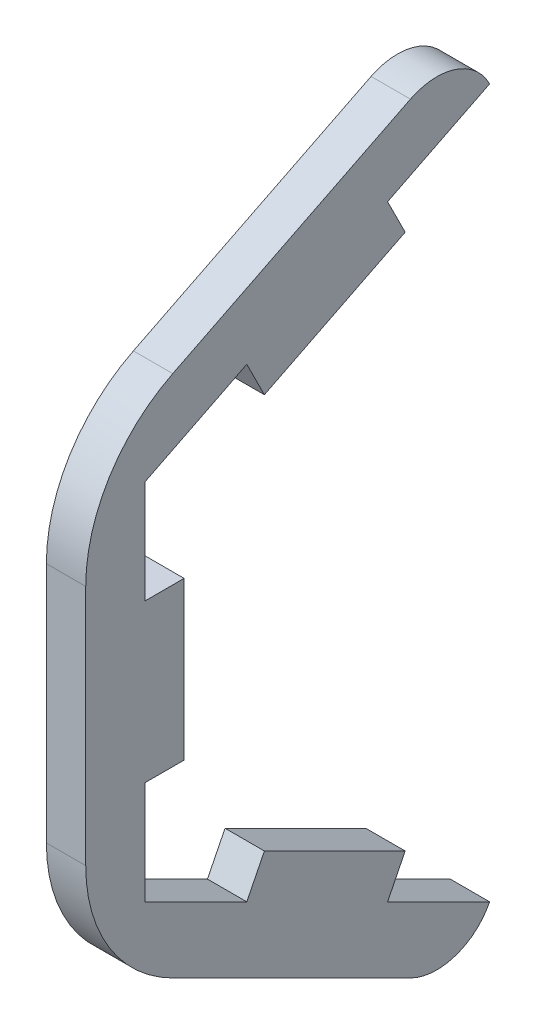
ISO-10303-21;
HEADER;
FILE_DESCRIPTION(('STEP AP214'),'2;1');
FILE_NAME('part.step','',(''),(''),'','','');
FILE_SCHEMA(('AUTOMOTIVE_DESIGN { 1 0 10303 214 1 1 1 1 }'));
ENDSEC;
DATA;
#1=APPLICATION_CONTEXT('core data for automotive mechanical design processes');
#2=APPLICATION_PROTOCOL_DEFINITION('international standard','automotive_design',2000,#1);
#3=PRODUCT_CONTEXT('',#1,'mechanical');
#4=PRODUCT('Part','Part','',(#3));
#5=PRODUCT_RELATED_PRODUCT_CATEGORY('part','',(#4));
#6=PRODUCT_DEFINITION_FORMATION('','',#4);
#7=PRODUCT_DEFINITION_CONTEXT('part definition',#1,'design');
#8=PRODUCT_DEFINITION('design','',#6,#7);
#9=PRODUCT_DEFINITION_SHAPE('','',#8);
#10=(LENGTH_UNIT() NAMED_UNIT(*) SI_UNIT(.MILLI.,.METRE.));
#11=(NAMED_UNIT(*) PLANE_ANGLE_UNIT() SI_UNIT($,.RADIAN.));
#12=(NAMED_UNIT(*) SI_UNIT($,.STERADIAN.) SOLID_ANGLE_UNIT());
#13=UNCERTAINTY_MEASURE_WITH_UNIT(LENGTH_MEASURE(1.E-05),#10,'distance_accuracy_value','');
#14=(GEOMETRIC_REPRESENTATION_CONTEXT(3) GLOBAL_UNCERTAINTY_ASSIGNED_CONTEXT((#13)) GLOBAL_UNIT_ASSIGNED_CONTEXT((#10,
#11,#12)) REPRESENTATION_CONTEXT('',''));
#15=CARTESIAN_POINT('',(0.,0.,0.));
#16=DIRECTION('',(0.,0.,1.));
#17=DIRECTION('',(1.,0.,0.));
#18=AXIS2_PLACEMENT_3D('',#15,#16,#17);
#19=CARTESIAN_POINT('',(6.35,110.581612662849,55.2908063314247));
#20=DIRECTION('',(0.,0.894427190999916,0.447213595499958));
#21=DIRECTION('',(0.,-0.447213595499958,0.894427190999916));
#22=AXIS2_PLACEMENT_3D('',#19,#20,#21);
#23=PLANE('',#22);
#24=DIRECTION('',(0.,-0.447213595499958,0.894427190999916));
#25=VECTOR('',#24,1.);
#26=CARTESIAN_POINT('',(12.7,110.581612662849,55.2908063314247));
#27=LINE('',#26,#25);
#28=CARTESIAN_POINT('',(12.7,57.15,162.154031657124));
#29=VERTEX_POINT('',#28);
#30=CARTESIAN_POINT('',(12.7,48.9168705771304,178.620290502863));
#31=VERTEX_POINT('',#30);
#32=EDGE_CURVE('E199',#29,#31,#27,.T.);
#33=ORIENTED_EDGE('',*,*,#32,.T.);
#34=DIRECTION('',(1.,0.,0.));
#35=VECTOR('',#34,1.);
#36=CARTESIAN_POINT('',(-24.3672020210175,48.9168705771304,178.620290502863));
#37=LINE('',#36,#35);
#38=CARTESIAN_POINT('',(6.35,48.9168705771304,178.620290502863));
#39=VERTEX_POINT('',#38);
#40=EDGE_CURVE('E226',#39,#31,#37,.T.);
#41=ORIENTED_EDGE('',*,*,#40,.F.);
#42=DIRECTION('',(0.,-0.447213595499958,0.894427190999916));
#43=VECTOR('',#42,1.);
#44=CARTESIAN_POINT('',(6.35,110.581612662849,55.2908063314247));
#45=LINE('',#44,#43);
#46=CARTESIAN_POINT('',(6.35,57.15,162.154031657124));
#47=VERTEX_POINT('',#46);
#48=EDGE_CURVE('E295',#47,#39,#45,.T.);
#49=ORIENTED_EDGE('',*,*,#48,.F.);
#50=DIRECTION('',(1.,0.,0.));
#51=VECTOR('',#50,1.);
#52=CARTESIAN_POINT('',(6.35,57.15,162.154031657124));
#53=LINE('',#52,#51);
#54=EDGE_CURVE('E303',#47,#29,#53,.T.);
#55=ORIENTED_EDGE('',*,*,#54,.T.);
#56=EDGE_LOOP('',(#33,#41,#49,#55));
#57=FACE_BOUND('',#56,.T.);
#58=ADVANCED_FACE('F35',(#57),#23,.F.);
#59=CARTESIAN_POINT('',(6.35,-110.581612662849,55.2908063314247));
#60=DIRECTION('',(0.,-0.894427190999916,0.447213595499958));
#61=DIRECTION('',(0.,-0.447213595499958,-0.894427190999916));
#62=AXIS2_PLACEMENT_3D('',#59,#60,#61);
#63=PLANE('',#62);
#64=DIRECTION('',(0.,-0.447213595499958,-0.894427190999916));
#65=VECTOR('',#64,1.);
#66=CARTESIAN_POINT('',(12.7,-110.581612662849,55.2908063314247));
#67=LINE('',#66,#65);
#68=CARTESIAN_POINT('',(12.7,-29.3245158285618,217.805));
#69=VERTEX_POINT('',#68);
#70=CARTESIAN_POINT('',(12.7,-37.5576452514315,201.338741154261));
#71=VERTEX_POINT('',#70);
#72=EDGE_CURVE('E299',#69,#71,#67,.T.);
#73=ORIENTED_EDGE('',*,*,#72,.T.);
#74=DIRECTION('',(1.,0.,0.));
#75=VECTOR('',#74,1.);
#76=CARTESIAN_POINT('',(-24.3672020210175,-37.5576452514315,201.338741154261));
#77=LINE('',#76,#75);
#78=CARTESIAN_POINT('',(6.35,-37.5576452514315,201.338741154261));
#79=VERTEX_POINT('',#78);
#80=EDGE_CURVE('E239',#79,#71,#77,.T.);
#81=ORIENTED_EDGE('',*,*,#80,.F.);
#82=DIRECTION('',(0.,-0.447213595499958,-0.894427190999916));
#83=VECTOR('',#82,1.);
#84=CARTESIAN_POINT('',(6.35,-110.581612662849,55.2908063314247));
#85=LINE('',#84,#83);
#86=CARTESIAN_POINT('',(6.35,-29.3245158285618,217.805));
#87=VERTEX_POINT('',#86);
#88=EDGE_CURVE('E287',#87,#79,#85,.T.);
#89=ORIENTED_EDGE('',*,*,#88,.F.);
#90=DIRECTION('',(1.,0.,0.));
#91=VECTOR('',#90,1.);
#92=CARTESIAN_POINT('',(6.35,-29.3245158285618,217.805));
#93=LINE('',#92,#91);
#94=EDGE_CURVE('E309',#87,#69,#93,.T.);
#95=ORIENTED_EDGE('',*,*,#94,.T.);
#96=EDGE_LOOP('',(#73,#81,#89,#95));
#97=FACE_BOUND('',#96,.T.);
#98=ADVANCED_FACE('F385',(#97),#63,.F.);
#99=CARTESIAN_POINT('',(6.35,0.,217.805));
#100=DIRECTION('',(0.,0.,1.));
#101=DIRECTION('',(1.,0.,0.));
#102=AXIS2_PLACEMENT_3D('',#99,#100,#101);
#103=PLANE('',#102);
#104=DIRECTION('',(0.,-1.,0.));
#105=VECTOR('',#104,1.);
#106=CARTESIAN_POINT('',(12.7,0.,217.805));
#107=LINE('',#106,#105);
#108=CARTESIAN_POINT('',(12.7,29.3245158285619,217.805));
#109=VERTEX_POINT('',#108);
#110=CARTESIAN_POINT('',(12.7,12.7,217.805));
#111=VERTEX_POINT('',#110);
#112=EDGE_CURVE('E195',#109,#111,#107,.T.);
#113=ORIENTED_EDGE('',*,*,#112,.T.);
#114=DIRECTION('',(1.,0.,0.));
#115=VECTOR('',#114,1.);
#116=CARTESIAN_POINT('',(-24.3672020210175,12.7,217.805));
#117=LINE('',#116,#115);
#118=CARTESIAN_POINT('',(6.35,12.7,217.805));
#119=VERTEX_POINT('',#118);
#120=EDGE_CURVE('E265',#119,#111,#117,.T.);
#121=ORIENTED_EDGE('',*,*,#120,.F.);
#122=DIRECTION('',(0.,-1.,0.));
#123=VECTOR('',#122,1.);
#124=CARTESIAN_POINT('',(6.35,0.,217.805));
#125=LINE('',#124,#123);
#126=CARTESIAN_POINT('',(6.35,29.3245158285619,217.805));
#127=VERTEX_POINT('',#126);
#128=EDGE_CURVE('E292',#127,#119,#125,.T.);
#129=ORIENTED_EDGE('',*,*,#128,.F.);
#130=DIRECTION('',(1.,0.,0.));
#131=VECTOR('',#130,1.);
#132=CARTESIAN_POINT('',(6.35,29.3245158285619,217.805));
#133=LINE('',#132,#131);
#134=EDGE_CURVE('E307',#127,#109,#133,.T.);
#135=ORIENTED_EDGE('',*,*,#134,.T.);
#136=EDGE_LOOP('',(#113,#121,#129,#135));
#137=FACE_BOUND('',#136,.T.);
#138=ADVANCED_FACE('F390',(#137),#103,.F.);
#139=CARTESIAN_POINT('',(6.35,37.5576452514315,201.338741154261));
#140=VERTEX_POINT('',#139);
#141=EDGE_CURVE('E204',#140,#127,#45,.T.);
#142=ORIENTED_EDGE('',*,*,#141,.F.);
#143=DIRECTION('',(1.,0.,0.));
#144=VECTOR('',#143,1.);
#145=CARTESIAN_POINT('',(-24.3672020210175,37.5576452514315,201.338741154261));
#146=LINE('',#145,#144);
#147=CARTESIAN_POINT('',(12.7,37.5576452514315,201.338741154261));
#148=VERTEX_POINT('',#147);
#149=EDGE_CURVE('E202',#140,#148,#146,.T.);
#150=ORIENTED_EDGE('',*,*,#149,.T.);
#151=EDGE_CURVE('E187',#148,#109,#27,.T.);
#152=ORIENTED_EDGE('',*,*,#151,.T.);
#153=ORIENTED_EDGE('',*,*,#134,.F.);
#154=EDGE_LOOP('',(#142,#150,#152,#153));
#155=FACE_BOUND('',#154,.T.);
#156=ADVANCED_FACE('F203',(#155),#23,.F.);
#157=CARTESIAN_POINT('',(6.35,-12.7,217.805));
#158=VERTEX_POINT('',#157);
#159=EDGE_CURVE('E290',#158,#87,#125,.T.);
#160=ORIENTED_EDGE('',*,*,#159,.F.);
#161=DIRECTION('',(1.,0.,0.));
#162=VECTOR('',#161,1.);
#163=CARTESIAN_POINT('',(-24.3672020210175,-12.7,217.805));
#164=LINE('',#163,#162);
#165=CARTESIAN_POINT('',(12.7,-12.7,217.805));
#166=VERTEX_POINT('',#165);
#167=EDGE_CURVE('E275',#158,#166,#164,.T.);
#168=ORIENTED_EDGE('',*,*,#167,.T.);
#169=EDGE_CURVE('E301',#166,#69,#107,.T.);
#170=ORIENTED_EDGE('',*,*,#169,.T.);
#171=ORIENTED_EDGE('',*,*,#94,.F.);
#172=EDGE_LOOP('',(#160,#168,#170,#171));
#173=FACE_BOUND('',#172,.T.);
#174=ADVANCED_FACE('F397',(#173),#103,.F.);
#175=CARTESIAN_POINT('',(6.35,-48.9168705771304,178.620290502863));
#176=VERTEX_POINT('',#175);
#177=CARTESIAN_POINT('',(6.35,-57.15,162.154031657124));
#178=VERTEX_POINT('',#177);
#179=EDGE_CURVE('E291',#176,#178,#85,.T.);
#180=ORIENTED_EDGE('',*,*,#179,.F.);
#181=DIRECTION('',(1.,0.,0.));
#182=VECTOR('',#181,1.);
#183=CARTESIAN_POINT('',(-24.3672020210175,-48.9168705771304,178.620290502863));
#184=LINE('',#183,#182);
#185=CARTESIAN_POINT('',(12.7,-48.9168705771304,178.620290502863));
#186=VERTEX_POINT('',#185);
#187=EDGE_CURVE('E250',#176,#186,#184,.T.);
#188=ORIENTED_EDGE('',*,*,#187,.T.);
#189=CARTESIAN_POINT('',(12.7,-57.15,162.154031657124));
#190=VERTEX_POINT('',#189);
#191=EDGE_CURVE('E286',#186,#190,#67,.T.);
#192=ORIENTED_EDGE('',*,*,#191,.T.);
#193=DIRECTION('',(1.,0.,0.));
#194=VECTOR('',#193,1.);
#195=CARTESIAN_POINT('',(6.35,-57.15,162.154031657124));
#196=LINE('',#195,#194);
#197=EDGE_CURVE('E298',#178,#190,#196,.T.);
#198=ORIENTED_EDGE('',*,*,#197,.F.);
#199=EDGE_LOOP('',(#180,#188,#192,#198));
#200=FACE_BOUND('',#199,.T.);
#201=ADVANCED_FACE('F393',(#200),#63,.F.);
#202=CARTESIAN_POINT('',(6.35,0.,0.));
#203=DIRECTION('',(1.,0.,0.));
#204=DIRECTION('',(0.,0.,-1.));
#205=AXIS2_PLACEMENT_3D('',#202,#203,#204);
#206=PLANE('',#205);
#207=DIRECTION('',(0.,0.447213595499957,0.894427190999916));
#208=VECTOR('',#207,1.);
#209=CARTESIAN_POINT('',(6.35,-50.3367737428428,197.079031657124));
#210=LINE('',#209,#208);
#211=CARTESIAN_POINT('',(6.35,-61.4097094971371,174.933160148535));
#212=VERTEX_POINT('',#211);
#213=CARTESIAN_POINT('',(6.35,-42.2316769085551,213.289225325699));
#214=VERTEX_POINT('',#213);
#215=EDGE_CURVE('E341',#212,#214,#210,.T.);
#216=ORIENTED_EDGE('',*,*,#215,.T.);
#217=CARTESIAN_POINT('',(6.35,-19.5132262571572,201.93));
#218=DIRECTION('',(1.,0.,0.));
#219=DIRECTION('',(0.,0.,-1.));
#220=AXIS2_PLACEMENT_3D('',#217,#218,#219);
#221=CIRCLE('',#220,25.4);
#222=CARTESIAN_POINT('',(6.35,-19.5132262571572,227.33));
#223=VERTEX_POINT('',#222);
#224=EDGE_CURVE('E43',#214,#223,#221,.F.);
#225=ORIENTED_EDGE('',*,*,#224,.T.);
#226=DIRECTION('',(0.,1.,0.));
#227=VECTOR('',#226,1.);
#228=CARTESIAN_POINT('',(6.35,-35.2112895714046,227.33));
#229=LINE('',#228,#227);
#230=CARTESIAN_POINT('',(6.35,19.5132262571573,227.33));
#231=VERTEX_POINT('',#230);
#232=EDGE_CURVE('E218',#223,#231,#229,.T.);
#233=ORIENTED_EDGE('',*,*,#232,.T.);
#234=CARTESIAN_POINT('',(6.35,19.5132262571573,201.93));
#235=DIRECTION('',(1.,0.,0.));
#236=DIRECTION('',(0.,0.,-1.));
#237=AXIS2_PLACEMENT_3D('',#234,#235,#236);
#238=CIRCLE('',#237,25.4);
#239=CARTESIAN_POINT('',(6.35,42.2316769085552,213.289225325699));
#240=VERTEX_POINT('',#239);
#241=EDGE_CURVE('E50',#231,#240,#238,.F.);
#242=ORIENTED_EDGE('',*,*,#241,.T.);
#243=DIRECTION('',(0.,0.447213595499958,-0.894427190999916));
#244=VECTOR('',#243,1.);
#245=CARTESIAN_POINT('',(6.35,35.2112895714046,227.33));
#246=LINE('',#245,#244);
#247=CARTESIAN_POINT('',(6.35,61.4097094971372,174.933160148535));
#248=VERTEX_POINT('',#247);
#249=EDGE_CURVE('E215',#240,#248,#246,.T.);
#250=ORIENTED_EDGE('',*,*,#249,.T.);
#251=CARTESIAN_POINT('',(6.35,52.8902905028629,170.673450651398));
#252=DIRECTION('',(1.,0.,0.));
#253=DIRECTION('',(0.,0.,-1.));
#254=AXIS2_PLACEMENT_3D('',#251,#252,#253);
#255=CIRCLE('',#254,9.525);
#256=EDGE_CURVE('E321',#248,#47,#255,.F.);
#257=ORIENTED_EDGE('',*,*,#256,.T.);
#258=ORIENTED_EDGE('',*,*,#48,.T.);
#259=DIRECTION('',(0.,-0.894427190999917,-0.447213595499956));
#260=VECTOR('',#259,1.);
#261=CARTESIAN_POINT('',(6.35,43.2372579142809,175.780484171438));
#262=LINE('',#261,#260);
#263=CARTESIAN_POINT('',(6.35,43.2372579142809,175.780484171438));
#264=VERTEX_POINT('',#263);
#265=EDGE_CURVE('E221',#39,#264,#262,.T.);
#266=ORIENTED_EDGE('',*,*,#265,.T.);
#267=DIRECTION('',(0.,-0.447213595499957,0.894427190999917));
#268=VECTOR('',#267,1.);
#269=CARTESIAN_POINT('',(6.35,31.878032588582,198.498934822836));
#270=LINE('',#269,#268);
#271=CARTESIAN_POINT('',(6.35,31.878032588582,198.498934822836));
#272=VERTEX_POINT('',#271);
#273=EDGE_CURVE('E229',#264,#272,#270,.T.);
#274=ORIENTED_EDGE('',*,*,#273,.T.);
#275=DIRECTION('',(0.,0.894427190999917,0.447213595499957));
#276=VECTOR('',#275,1.);
#277=CARTESIAN_POINT('',(6.35,37.5576452514315,201.338741154261));
#278=LINE('',#277,#276);
#279=EDGE_CURVE('E233',#272,#140,#278,.T.);
#280=ORIENTED_EDGE('',*,*,#279,.T.);
#281=ORIENTED_EDGE('',*,*,#141,.T.);
#282=ORIENTED_EDGE('',*,*,#128,.T.);
#283=DIRECTION('',(0.,0.,-1.));
#284=VECTOR('',#283,1.);
#285=CARTESIAN_POINT('',(6.35,12.7,217.805));
#286=LINE('',#285,#284);
#287=CARTESIAN_POINT('',(6.35,12.7,211.455));
#288=VERTEX_POINT('',#287);
#289=EDGE_CURVE('E264',#119,#288,#286,.T.);
#290=ORIENTED_EDGE('',*,*,#289,.T.);
#291=DIRECTION('',(0.,-1.,0.));
#292=VECTOR('',#291,1.);
#293=CARTESIAN_POINT('',(6.35,12.7,211.455));
#294=LINE('',#293,#292);
#295=CARTESIAN_POINT('',(6.35,-12.7,211.455));
#296=VERTEX_POINT('',#295);
#297=EDGE_CURVE('E262',#288,#296,#294,.T.);
#298=ORIENTED_EDGE('',*,*,#297,.T.);
#299=DIRECTION('',(0.,0.,1.));
#300=VECTOR('',#299,1.);
#301=CARTESIAN_POINT('',(6.35,-12.7,217.805));
#302=LINE('',#301,#300);
#303=EDGE_CURVE('E267',#296,#158,#302,.T.);
#304=ORIENTED_EDGE('',*,*,#303,.T.);
#305=ORIENTED_EDGE('',*,*,#159,.T.);
#306=ORIENTED_EDGE('',*,*,#88,.T.);
#307=DIRECTION('',(0.,0.894427190999917,-0.447213595499956));
#308=VECTOR('',#307,1.);
#309=CARTESIAN_POINT('',(6.35,-31.878032588582,198.498934822836));
#310=LINE('',#309,#308);
#311=CARTESIAN_POINT('',(6.35,-31.878032588582,198.498934822836));
#312=VERTEX_POINT('',#311);
#313=EDGE_CURVE('E238',#79,#312,#310,.T.);
#314=ORIENTED_EDGE('',*,*,#313,.T.);
#315=DIRECTION('',(0.,-0.447213595499958,-0.894427190999916));
#316=VECTOR('',#315,1.);
#317=CARTESIAN_POINT('',(6.35,-43.2372579142809,175.780484171438));
#318=LINE('',#317,#316);
#319=CARTESIAN_POINT('',(6.35,-43.2372579142809,175.780484171438));
#320=VERTEX_POINT('',#319);
#321=EDGE_CURVE('E236',#312,#320,#318,.T.);
#322=ORIENTED_EDGE('',*,*,#321,.T.);
#323=DIRECTION('',(0.,-0.894427190999919,0.447213595499953));
#324=VECTOR('',#323,1.);
#325=CARTESIAN_POINT('',(6.35,-48.9168705771304,178.620290502863));
#326=LINE('',#325,#324);
#327=EDGE_CURVE('E241',#320,#176,#326,.T.);
#328=ORIENTED_EDGE('',*,*,#327,.T.);
#329=ORIENTED_EDGE('',*,*,#179,.T.);
#330=CARTESIAN_POINT('',(6.35,-52.8902905028629,170.673450651398));
#331=DIRECTION('',(1.,0.,0.));
#332=DIRECTION('',(0.,0.,-1.));
#333=AXIS2_PLACEMENT_3D('',#330,#331,#332);
#334=CIRCLE('',#333,9.525);
#335=EDGE_CURVE('E323',#178,#212,#334,.F.);
#336=ORIENTED_EDGE('',*,*,#335,.T.);
#337=EDGE_LOOP('',(#216,#225,#233,#242,#250,#257,#258,#266,#274,#280,#281,#282,#290,#298,#304,
#305,#306,#314,#322,#328,#329,#336));
#338=FACE_BOUND('',#337,.T.);
#339=ADVANCED_FACE('F340',(#338),#206,.F.);
#340=CARTESIAN_POINT('',(12.7,0.,0.));
#341=DIRECTION('',(1.,0.,0.));
#342=DIRECTION('',(0.,0.,-1.));
#343=AXIS2_PLACEMENT_3D('',#340,#341,#342);
#344=PLANE('',#343);
#345=DIRECTION('',(0.,1.,0.));
#346=VECTOR('',#345,1.);
#347=CARTESIAN_POINT('',(12.7,3.175,227.33));
#348=LINE('',#347,#346);
#349=CARTESIAN_POINT('',(12.7,-19.5132262571572,227.33));
#350=VERTEX_POINT('',#349);
#351=CARTESIAN_POINT('',(12.7,19.5132262571573,227.33));
#352=VERTEX_POINT('',#351);
#353=EDGE_CURVE('E352',#350,#352,#348,.T.);
#354=ORIENTED_EDGE('',*,*,#353,.F.);
#355=CARTESIAN_POINT('',(12.7,-19.5132262571572,201.93));
#356=DIRECTION('',(1.,0.,0.));
#357=DIRECTION('',(0.,0.,-1.));
#358=AXIS2_PLACEMENT_3D('',#355,#356,#357);
#359=CIRCLE('',#358,25.4);
#360=CARTESIAN_POINT('',(12.7,-42.2316769085551,213.289225325699));
#361=VERTEX_POINT('',#360);
#362=EDGE_CURVE('E335',#350,#361,#359,.T.);
#363=ORIENTED_EDGE('',*,*,#362,.T.);
#364=DIRECTION('',(0.,0.447213595499958,0.894427190999916));
#365=VECTOR('',#364,1.);
#366=CARTESIAN_POINT('',(12.7,-50.3367737428428,197.079031657124));
#367=LINE('',#366,#365);
#368=CARTESIAN_POINT('',(12.7,-61.4097094971371,174.933160148535));
#369=VERTEX_POINT('',#368);
#370=EDGE_CURVE('E351',#369,#361,#367,.T.);
#371=ORIENTED_EDGE('',*,*,#370,.F.);
#372=CARTESIAN_POINT('',(12.7,-52.8902905028629,170.673450651398));
#373=DIRECTION('',(1.,0.,0.));
#374=DIRECTION('',(0.,0.,-1.));
#375=AXIS2_PLACEMENT_3D('',#372,#373,#374);
#376=CIRCLE('',#375,9.525);
#377=EDGE_CURVE('E319',#369,#190,#376,.T.);
#378=ORIENTED_EDGE('',*,*,#377,.T.);
#379=ORIENTED_EDGE('',*,*,#191,.F.);
#380=DIRECTION('',(0.,0.894427190999918,-0.447213595499953));
#381=VECTOR('',#380,1.);
#382=CARTESIAN_POINT('',(12.7,-48.9168705771304,178.620290502863));
#383=LINE('',#382,#381);
#384=CARTESIAN_POINT('',(12.7,-43.2372579142809,175.780484171438));
#385=VERTEX_POINT('',#384);
#386=EDGE_CURVE('E235',#186,#385,#383,.T.);
#387=ORIENTED_EDGE('',*,*,#386,.T.);
#388=DIRECTION('',(0.,0.447213595499958,0.894427190999916));
#389=VECTOR('',#388,1.);
#390=CARTESIAN_POINT('',(12.7,-43.2372579142809,175.780484171438));
#391=LINE('',#390,#389);
#392=CARTESIAN_POINT('',(12.7,-31.878032588582,198.498934822836));
#393=VERTEX_POINT('',#392);
#394=EDGE_CURVE('E244',#385,#393,#391,.T.);
#395=ORIENTED_EDGE('',*,*,#394,.T.);
#396=DIRECTION('',(0.,-0.894427190999917,0.447213595499956));
#397=VECTOR('',#396,1.);
#398=CARTESIAN_POINT('',(12.7,-31.878032588582,198.498934822836));
#399=LINE('',#398,#397);
#400=EDGE_CURVE('E247',#393,#71,#399,.T.);
#401=ORIENTED_EDGE('',*,*,#400,.T.);
#402=ORIENTED_EDGE('',*,*,#72,.F.);
#403=ORIENTED_EDGE('',*,*,#169,.F.);
#404=DIRECTION('',(0.,0.,-1.));
#405=VECTOR('',#404,1.);
#406=CARTESIAN_POINT('',(12.7,-12.7,217.805));
#407=LINE('',#406,#405);
#408=CARTESIAN_POINT('',(12.7,-12.7,211.455));
#409=VERTEX_POINT('',#408);
#410=EDGE_CURVE('E261',#166,#409,#407,.T.);
#411=ORIENTED_EDGE('',*,*,#410,.T.);
#412=DIRECTION('',(0.,1.,0.));
#413=VECTOR('',#412,1.);
#414=CARTESIAN_POINT('',(12.7,12.7,211.455));
#415=LINE('',#414,#413);
#416=CARTESIAN_POINT('',(12.7,12.7,211.455));
#417=VERTEX_POINT('',#416);
#418=EDGE_CURVE('E270',#409,#417,#415,.T.);
#419=ORIENTED_EDGE('',*,*,#418,.T.);
#420=DIRECTION('',(0.,0.,1.));
#421=VECTOR('',#420,1.);
#422=CARTESIAN_POINT('',(12.7,12.7,217.805));
#423=LINE('',#422,#421);
#424=EDGE_CURVE('E273',#417,#111,#423,.T.);
#425=ORIENTED_EDGE('',*,*,#424,.T.);
#426=ORIENTED_EDGE('',*,*,#112,.F.);
#427=ORIENTED_EDGE('',*,*,#151,.F.);
#428=DIRECTION('',(0.,-0.894427190999917,-0.447213595499957));
#429=VECTOR('',#428,1.);
#430=CARTESIAN_POINT('',(12.7,37.5576452514315,201.338741154261));
#431=LINE('',#430,#429);
#432=CARTESIAN_POINT('',(12.7,31.878032588582,198.498934822836));
#433=VERTEX_POINT('',#432);
#434=EDGE_CURVE('E193',#148,#433,#431,.T.);
#435=ORIENTED_EDGE('',*,*,#434,.T.);
#436=DIRECTION('',(0.,0.447213595499957,-0.894427190999916));
#437=VECTOR('',#436,1.);
#438=CARTESIAN_POINT('',(12.7,31.878032588582,198.498934822836));
#439=LINE('',#438,#437);
#440=CARTESIAN_POINT('',(12.7,43.2372579142809,175.780484171438));
#441=VERTEX_POINT('',#440);
#442=EDGE_CURVE('E214',#433,#441,#439,.T.);
#443=ORIENTED_EDGE('',*,*,#442,.T.);
#444=DIRECTION('',(0.,0.894427190999917,0.447213595499956));
#445=VECTOR('',#444,1.);
#446=CARTESIAN_POINT('',(12.7,43.2372579142809,175.780484171438));
#447=LINE('',#446,#445);
#448=EDGE_CURVE('E209',#441,#31,#447,.T.);
#449=ORIENTED_EDGE('',*,*,#448,.T.);
#450=ORIENTED_EDGE('',*,*,#32,.F.);
#451=CARTESIAN_POINT('',(12.7,52.8902905028629,170.673450651398));
#452=DIRECTION('',(1.,0.,0.));
#453=DIRECTION('',(0.,0.,-1.));
#454=AXIS2_PLACEMENT_3D('',#451,#452,#453);
#455=CIRCLE('',#454,9.525);
#456=CARTESIAN_POINT('',(12.7,61.4097094971371,174.933160148535));
#457=VERTEX_POINT('',#456);
#458=EDGE_CURVE('E316',#29,#457,#455,.T.);
#459=ORIENTED_EDGE('',*,*,#458,.T.);
#460=DIRECTION('',(0.,0.447213595499956,-0.894427190999917));
#461=VECTOR('',#460,1.);
#462=CARTESIAN_POINT('',(12.7,50.3367737428428,197.079031657124));
#463=LINE('',#462,#461);
#464=CARTESIAN_POINT('',(12.7,42.2316769085552,213.289225325699));
#465=VERTEX_POINT('',#464);
#466=EDGE_CURVE('E356',#465,#457,#463,.T.);
#467=ORIENTED_EDGE('',*,*,#466,.F.);
#468=CARTESIAN_POINT('',(12.7,19.5132262571573,201.93));
#469=DIRECTION('',(1.,0.,0.));
#470=DIRECTION('',(0.,0.,-1.));
#471=AXIS2_PLACEMENT_3D('',#468,#469,#470);
#472=CIRCLE('',#471,25.4);
#473=EDGE_CURVE('E333',#465,#352,#472,.T.);
#474=ORIENTED_EDGE('',*,*,#473,.T.);
#475=EDGE_LOOP('',(#354,#363,#371,#378,#379,#387,#395,#401,#402,#403,#411,#419,#425,#426,#427,
#435,#443,#449,#450,#459,#467,#474));
#476=FACE_BOUND('',#475,.T.);
#477=ADVANCED_FACE('F190',(#476),#344,.T.);
#478=CARTESIAN_POINT('',(-24.3672020210175,12.7,217.805));
#479=DIRECTION('',(0.,1.,0.));
#480=DIRECTION('',(0.,0.,1.));
#481=AXIS2_PLACEMENT_3D('',#478,#479,#480);
#482=PLANE('',#481);
#483=ORIENTED_EDGE('',*,*,#289,.F.);
#484=ORIENTED_EDGE('',*,*,#120,.T.);
#485=ORIENTED_EDGE('',*,*,#424,.F.);
#486=DIRECTION('',(1.,0.,0.));
#487=VECTOR('',#486,1.);
#488=CARTESIAN_POINT('',(-24.3672020210175,12.7,211.455));
#489=LINE('',#488,#487);
#490=EDGE_CURVE('E278',#288,#417,#489,.T.);
#491=ORIENTED_EDGE('',*,*,#490,.F.);
#492=EDGE_LOOP('',(#483,#484,#485,#491));
#493=FACE_BOUND('',#492,.T.);
#494=ADVANCED_FACE('F465',(#493),#482,.T.);
#495=CARTESIAN_POINT('',(-24.3672020210175,12.7,211.455));
#496=DIRECTION('',(0.,0.,-1.));
#497=DIRECTION('',(0.,1.,0.));
#498=AXIS2_PLACEMENT_3D('',#495,#496,#497);
#499=PLANE('',#498);
#500=ORIENTED_EDGE('',*,*,#297,.F.);
#501=ORIENTED_EDGE('',*,*,#490,.T.);
#502=ORIENTED_EDGE('',*,*,#418,.F.);
#503=DIRECTION('',(1.,0.,0.));
#504=VECTOR('',#503,1.);
#505=CARTESIAN_POINT('',(-24.3672020210175,-12.7,211.455));
#506=LINE('',#505,#504);
#507=EDGE_CURVE('E280',#296,#409,#506,.T.);
#508=ORIENTED_EDGE('',*,*,#507,.F.);
#509=EDGE_LOOP('',(#500,#501,#502,#508));
#510=FACE_BOUND('',#509,.T.);
#511=ADVANCED_FACE('F496',(#510),#499,.T.);
#512=CARTESIAN_POINT('',(-24.3672020210175,-12.7,217.805));
#513=DIRECTION('',(0.,-1.,0.));
#514=DIRECTION('',(0.,0.,-1.));
#515=AXIS2_PLACEMENT_3D('',#512,#513,#514);
#516=PLANE('',#515);
#517=ORIENTED_EDGE('',*,*,#303,.F.);
#518=ORIENTED_EDGE('',*,*,#507,.T.);
#519=ORIENTED_EDGE('',*,*,#410,.F.);
#520=ORIENTED_EDGE('',*,*,#167,.F.);
#521=EDGE_LOOP('',(#517,#518,#519,#520));
#522=FACE_BOUND('',#521,.T.);
#523=ADVANCED_FACE('F506',(#522),#516,.T.);
#524=CARTESIAN_POINT('',(-24.3672020210175,-31.878032588582,198.498934822836));
#525=DIRECTION('',(0.,0.447213595499956,0.894427190999917));
#526=DIRECTION('',(0.,-0.894427190999917,0.447213595499956));
#527=AXIS2_PLACEMENT_3D('',#524,#525,#526);
#528=PLANE('',#527);
#529=ORIENTED_EDGE('',*,*,#313,.F.);
#530=ORIENTED_EDGE('',*,*,#80,.T.);
#531=ORIENTED_EDGE('',*,*,#400,.F.);
#532=DIRECTION('',(1.,0.,0.));
#533=VECTOR('',#532,1.);
#534=CARTESIAN_POINT('',(-24.3672020210175,-31.878032588582,198.498934822836));
#535=LINE('',#534,#533);
#536=EDGE_CURVE('E253',#312,#393,#535,.T.);
#537=ORIENTED_EDGE('',*,*,#536,.F.);
#538=EDGE_LOOP('',(#529,#530,#531,#537));
#539=FACE_BOUND('',#538,.T.);
#540=ADVANCED_FACE('F516',(#539),#528,.T.);
#541=CARTESIAN_POINT('',(-24.3672020210175,-43.2372579142809,175.780484171438));
#542=DIRECTION('',(0.,0.894427190999916,-0.447213595499958));
#543=DIRECTION('',(0.,0.447213595499958,0.894427190999916));
#544=AXIS2_PLACEMENT_3D('',#541,#542,#543);
#545=PLANE('',#544);
#546=ORIENTED_EDGE('',*,*,#321,.F.);
#547=ORIENTED_EDGE('',*,*,#536,.T.);
#548=ORIENTED_EDGE('',*,*,#394,.F.);
#549=DIRECTION('',(1.,0.,0.));
#550=VECTOR('',#549,1.);
#551=CARTESIAN_POINT('',(-24.3672020210175,-43.2372579142809,175.780484171438));
#552=LINE('',#551,#550);
#553=EDGE_CURVE('E255',#320,#385,#552,.T.);
#554=ORIENTED_EDGE('',*,*,#553,.F.);
#555=EDGE_LOOP('',(#546,#547,#548,#554));
#556=FACE_BOUND('',#555,.T.);
#557=ADVANCED_FACE('F526',(#556),#545,.T.);
#558=CARTESIAN_POINT('',(-24.3672020210175,-48.9168705771304,178.620290502863));
#559=DIRECTION('',(0.,-0.447213595499953,-0.894427190999919));
#560=DIRECTION('',(0.,0.894427190999919,-0.447213595499953));
#561=AXIS2_PLACEMENT_3D('',#558,#559,#560);
#562=PLANE('',#561);
#563=ORIENTED_EDGE('',*,*,#327,.F.);
#564=ORIENTED_EDGE('',*,*,#553,.T.);
#565=ORIENTED_EDGE('',*,*,#386,.F.);
#566=ORIENTED_EDGE('',*,*,#187,.F.);
#567=EDGE_LOOP('',(#563,#564,#565,#566));
#568=FACE_BOUND('',#567,.T.);
#569=ADVANCED_FACE('F536',(#568),#562,.T.);
#570=CARTESIAN_POINT('',(-24.3672020210175,43.2372579142809,175.780484171438));
#571=DIRECTION('',(0.,0.447213595499956,-0.894427190999917));
#572=DIRECTION('',(0.,0.894427190999917,0.447213595499956));
#573=AXIS2_PLACEMENT_3D('',#570,#571,#572);
#574=PLANE('',#573);
#575=ORIENTED_EDGE('',*,*,#265,.F.);
#576=ORIENTED_EDGE('',*,*,#40,.T.);
#577=ORIENTED_EDGE('',*,*,#448,.F.);
#578=DIRECTION('',(1.,0.,0.));
#579=VECTOR('',#578,1.);
#580=CARTESIAN_POINT('',(-24.3672020210175,43.2372579142809,175.780484171438));
#581=LINE('',#580,#579);
#582=EDGE_CURVE('E230',#264,#441,#581,.T.);
#583=ORIENTED_EDGE('',*,*,#582,.F.);
#584=EDGE_LOOP('',(#575,#576,#577,#583));
#585=FACE_BOUND('',#584,.T.);
#586=ADVANCED_FACE('F367',(#585),#574,.T.);
#587=CARTESIAN_POINT('',(-24.3672020210175,31.878032588582,198.498934822836));
#588=DIRECTION('',(0.,-0.894427190999916,-0.447213595499957));
#589=DIRECTION('',(0.,0.447213595499957,-0.894427190999917));
#590=AXIS2_PLACEMENT_3D('',#587,#588,#589);
#591=PLANE('',#590);
#592=ORIENTED_EDGE('',*,*,#273,.F.);
#593=ORIENTED_EDGE('',*,*,#582,.T.);
#594=ORIENTED_EDGE('',*,*,#442,.F.);
#595=DIRECTION('',(1.,0.,0.));
#596=VECTOR('',#595,1.);
#597=CARTESIAN_POINT('',(-24.3672020210175,31.878032588582,198.498934822836));
#598=LINE('',#597,#596);
#599=EDGE_CURVE('E208',#272,#433,#598,.T.);
#600=ORIENTED_EDGE('',*,*,#599,.F.);
#601=EDGE_LOOP('',(#592,#593,#594,#600));
#602=FACE_BOUND('',#601,.T.);
#603=ADVANCED_FACE('F365',(#602),#591,.T.);
#604=CARTESIAN_POINT('',(-24.3672020210175,37.5576452514315,201.338741154261));
#605=DIRECTION('',(0.,-0.447213595499957,0.894427190999916));
#606=DIRECTION('',(0.,-0.894427190999917,-0.447213595499957));
#607=AXIS2_PLACEMENT_3D('',#604,#605,#606);
#608=PLANE('',#607);
#609=ORIENTED_EDGE('',*,*,#279,.F.);
#610=ORIENTED_EDGE('',*,*,#599,.T.);
#611=ORIENTED_EDGE('',*,*,#434,.F.);
#612=ORIENTED_EDGE('',*,*,#149,.F.);
#613=EDGE_LOOP('',(#609,#610,#611,#612));
#614=FACE_BOUND('',#613,.T.);
#615=ADVANCED_FACE('F211',(#614),#608,.T.);
#616=CARTESIAN_POINT('',(6.35,50.3367737428428,197.079031657124));
#617=DIRECTION('',(0.,-0.894427190999917,-0.447213595499956));
#618=DIRECTION('',(0.,0.447213595499956,-0.894427190999917));
#619=AXIS2_PLACEMENT_3D('',#616,#617,#618);
#620=PLANE('',#619);
#621=ORIENTED_EDGE('',*,*,#249,.F.);
#622=DIRECTION('',(1.,0.,0.));
#623=VECTOR('',#622,1.);
#624=CARTESIAN_POINT('',(6.35,42.2316769085552,213.289225325699));
#625=LINE('',#624,#623);
#626=EDGE_CURVE('E11',#240,#465,#625,.T.);
#627=ORIENTED_EDGE('',*,*,#626,.T.);
#628=ORIENTED_EDGE('',*,*,#466,.T.);
#629=DIRECTION('',(1.,0.,0.));
#630=VECTOR('',#629,1.);
#631=CARTESIAN_POINT('',(6.35,61.4097094971371,174.933160148535));
#632=LINE('',#631,#630);
#633=EDGE_CURVE('E325',#457,#248,#632,.F.);
#634=ORIENTED_EDGE('',*,*,#633,.T.);
#635=EDGE_LOOP('',(#621,#627,#628,#634));
#636=FACE_BOUND('',#635,.T.);
#637=ADVANCED_FACE('F377',(#636),#620,.F.);
#638=CARTESIAN_POINT('',(6.35,3.175,227.33));
#639=DIRECTION('',(0.,0.,-1.));
#640=DIRECTION('',(-1.,0.,0.));
#641=AXIS2_PLACEMENT_3D('',#638,#639,#640);
#642=PLANE('',#641);
#643=ORIENTED_EDGE('',*,*,#232,.F.);
#644=DIRECTION('',(1.,0.,0.));
#645=VECTOR('',#644,1.);
#646=CARTESIAN_POINT('',(6.35,-19.5132262571572,227.33));
#647=LINE('',#646,#645);
#648=EDGE_CURVE('E330',#223,#350,#647,.T.);
#649=ORIENTED_EDGE('',*,*,#648,.T.);
#650=ORIENTED_EDGE('',*,*,#353,.T.);
#651=DIRECTION('',(1.,0.,0.));
#652=VECTOR('',#651,1.);
#653=CARTESIAN_POINT('',(6.35,19.5132262571573,227.33));
#654=LINE('',#653,#652);
#655=EDGE_CURVE('E328',#352,#231,#654,.F.);
#656=ORIENTED_EDGE('',*,*,#655,.T.);
#657=EDGE_LOOP('',(#643,#649,#650,#656));
#658=FACE_BOUND('',#657,.T.);
#659=ADVANCED_FACE('F345',(#658),#642,.F.);
#660=CARTESIAN_POINT('',(6.35,-50.3367737428428,197.079031657124));
#661=DIRECTION('',(0.,0.894427190999916,-0.447213595499958));
#662=DIRECTION('',(0.,0.447213595499958,0.894427190999916));
#663=AXIS2_PLACEMENT_3D('',#660,#661,#662);
#664=PLANE('',#663);
#665=ORIENTED_EDGE('',*,*,#370,.T.);
#666=DIRECTION('',(1.,0.,0.));
#667=VECTOR('',#666,1.);
#668=CARTESIAN_POINT('',(6.35,-42.2316769085551,213.289225325699));
#669=LINE('',#668,#667);
#670=EDGE_CURVE('E58',#361,#214,#669,.F.);
#671=ORIENTED_EDGE('',*,*,#670,.T.);
#672=ORIENTED_EDGE('',*,*,#215,.F.);
#673=DIRECTION('',(1.,0.,0.));
#674=VECTOR('',#673,1.);
#675=CARTESIAN_POINT('',(12.7,-61.4097094971371,174.933160148535));
#676=LINE('',#675,#674);
#677=EDGE_CURVE('E306',#212,#369,#676,.T.);
#678=ORIENTED_EDGE('',*,*,#677,.T.);
#679=EDGE_LOOP('',(#665,#671,#672,#678));
#680=FACE_BOUND('',#679,.T.);
#681=ADVANCED_FACE('F353',(#680),#664,.F.);
#682=CARTESIAN_POINT('',(6.35,-52.8902905028629,170.673450651398));
#683=DIRECTION('',(-1.,0.,0.));
#684=DIRECTION('',(0.,0.,1.));
#685=AXIS2_PLACEMENT_3D('',#682,#683,#684);
#686=CYLINDRICAL_SURFACE('',#685,9.525);
#687=ORIENTED_EDGE('',*,*,#335,.F.);
#688=ORIENTED_EDGE('',*,*,#197,.T.);
#689=ORIENTED_EDGE('',*,*,#377,.F.);
#690=ORIENTED_EDGE('',*,*,#677,.F.);
#691=EDGE_LOOP('',(#687,#688,#689,#690));
#692=FACE_BOUND('',#691,.T.);
#693=ADVANCED_FACE('F409',(#692),#686,.T.);
#694=CARTESIAN_POINT('',(6.35,52.8902905028629,170.673450651398));
#695=DIRECTION('',(-1.,0.,0.));
#696=DIRECTION('',(0.,0.,1.));
#697=AXIS2_PLACEMENT_3D('',#694,#695,#696);
#698=CYLINDRICAL_SURFACE('',#697,9.525);
#699=ORIENTED_EDGE('',*,*,#256,.F.);
#700=ORIENTED_EDGE('',*,*,#633,.F.);
#701=ORIENTED_EDGE('',*,*,#458,.F.);
#702=ORIENTED_EDGE('',*,*,#54,.F.);
#703=EDGE_LOOP('',(#699,#700,#701,#702));
#704=FACE_BOUND('',#703,.T.);
#705=ADVANCED_FACE('F375',(#704),#698,.T.);
#706=CARTESIAN_POINT('',(6.35,-19.5132262571572,201.93));
#707=DIRECTION('',(1.,0.,0.));
#708=DIRECTION('',(0.,0.,-1.));
#709=AXIS2_PLACEMENT_3D('',#706,#707,#708);
#710=CYLINDRICAL_SURFACE('',#709,25.4);
#711=ORIENTED_EDGE('',*,*,#224,.F.);
#712=ORIENTED_EDGE('',*,*,#670,.F.);
#713=ORIENTED_EDGE('',*,*,#362,.F.);
#714=ORIENTED_EDGE('',*,*,#648,.F.);
#715=EDGE_LOOP('',(#711,#712,#713,#714));
#716=FACE_BOUND('',#715,.T.);
#717=ADVANCED_FACE('F349',(#716),#710,.T.);
#718=CARTESIAN_POINT('',(6.35,19.5132262571573,201.93));
#719=DIRECTION('',(1.,0.,0.));
#720=DIRECTION('',(0.,0.,-1.));
#721=AXIS2_PLACEMENT_3D('',#718,#719,#720);
#722=CYLINDRICAL_SURFACE('',#721,25.4);
#723=ORIENTED_EDGE('',*,*,#241,.F.);
#724=ORIENTED_EDGE('',*,*,#655,.F.);
#725=ORIENTED_EDGE('',*,*,#473,.F.);
#726=ORIENTED_EDGE('',*,*,#626,.F.);
#727=EDGE_LOOP('',(#723,#724,#725,#726));
#728=FACE_BOUND('',#727,.T.);
#729=ADVANCED_FACE('F37',(#728),#722,.T.);
#730=CLOSED_SHELL('',(#58,#98,#138,#156,#174,#201,#339,#477,#494,#511,#523,#540,#557,#569,#586,
#603,#615,#637,#659,#681,#693,#705,#717,#729));
#731=MANIFOLD_SOLID_BREP('B2',#730);
#732=ADVANCED_BREP_SHAPE_REPRESENTATION('',(#18,#731),#14);
#733=SHAPE_DEFINITION_REPRESENTATION(#9,#732);
ENDSEC;
END-ISO-10303-21;
